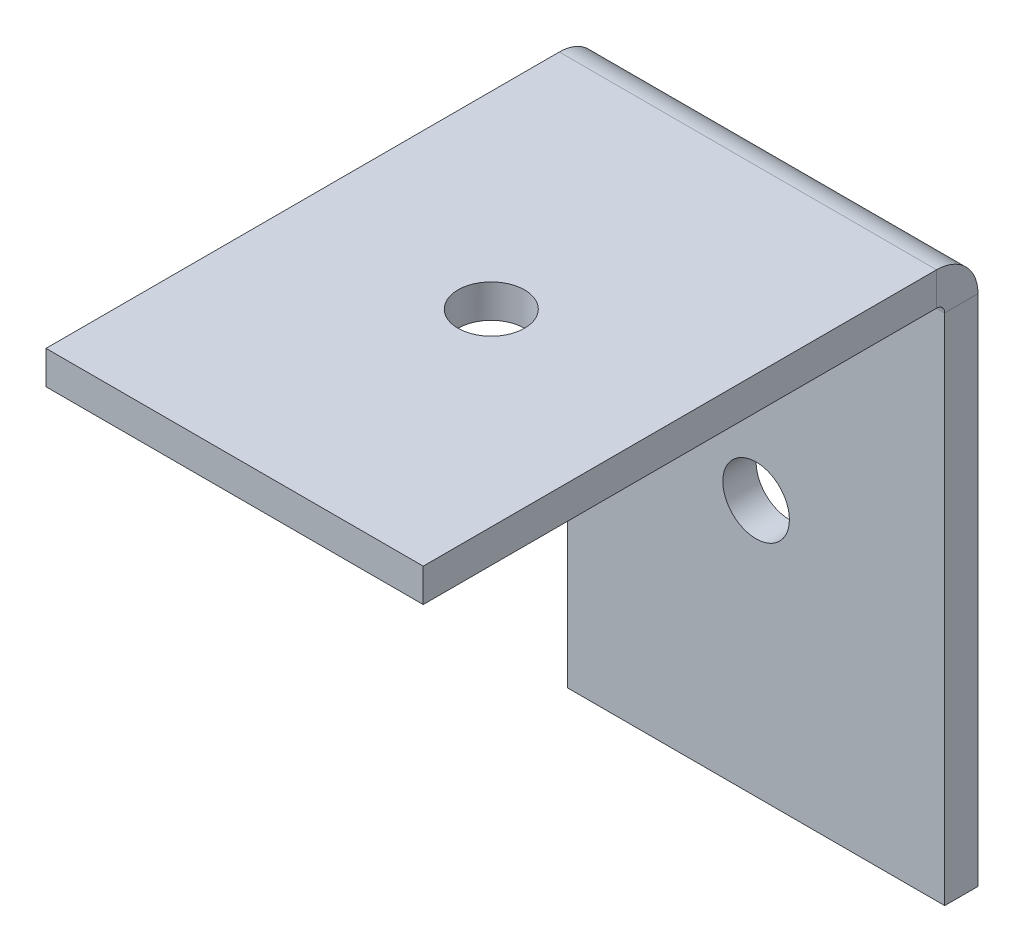
ISO-10303-21;
HEADER;
FILE_DESCRIPTION(('STEP AP214'),'2;1');
FILE_NAME('part.step','',(''),(''),'','','');
FILE_SCHEMA(('AUTOMOTIVE_DESIGN { 1 0 10303 214 1 1 1 1 }'));
ENDSEC;
DATA;
#1=APPLICATION_CONTEXT('core data for automotive mechanical design processes');
#2=APPLICATION_PROTOCOL_DEFINITION('international standard','automotive_design',2000,#1);
#3=PRODUCT_CONTEXT('',#1,'mechanical');
#4=PRODUCT('Part','Part','',(#3));
#5=PRODUCT_RELATED_PRODUCT_CATEGORY('part','',(#4));
#6=PRODUCT_DEFINITION_FORMATION('','',#4);
#7=PRODUCT_DEFINITION_CONTEXT('part definition',#1,'design');
#8=PRODUCT_DEFINITION('design','',#6,#7);
#9=PRODUCT_DEFINITION_SHAPE('','',#8);
#10=(LENGTH_UNIT() NAMED_UNIT(*) SI_UNIT(.MILLI.,.METRE.));
#11=(NAMED_UNIT(*) PLANE_ANGLE_UNIT() SI_UNIT($,.RADIAN.));
#12=(NAMED_UNIT(*) SI_UNIT($,.STERADIAN.) SOLID_ANGLE_UNIT());
#13=UNCERTAINTY_MEASURE_WITH_UNIT(LENGTH_MEASURE(1.E-05),#10,'distance_accuracy_value','');
#14=(GEOMETRIC_REPRESENTATION_CONTEXT(3) GLOBAL_UNCERTAINTY_ASSIGNED_CONTEXT((#13)) GLOBAL_UNIT_ASSIGNED_CONTEXT((#10,
#11,#12)) REPRESENTATION_CONTEXT('',''));
#15=CARTESIAN_POINT('',(0.,0.,0.));
#16=DIRECTION('',(0.,0.,1.));
#17=DIRECTION('',(1.,0.,0.));
#18=AXIS2_PLACEMENT_3D('',#15,#16,#17);
#19=CARTESIAN_POINT('',(0.,50.,3.));
#20=DIRECTION('',(0.,0.,-1.));
#21=DIRECTION('',(-1.,0.,0.));
#22=AXIS2_PLACEMENT_3D('',#19,#20,#21);
#23=PLANE('',#22);
#24=CARTESIAN_POINT('',(17.,23.1317,3.));
#25=DIRECTION('',(0.,0.,1.));
#26=DIRECTION('',(1.,0.,0.));
#27=AXIS2_PLACEMENT_3D('',#24,#25,#26);
#28=CIRCLE('',#27,3.);
#29=CARTESIAN_POINT('',(20.,23.1317,3.));
#30=VERTEX_POINT('',#29);
#31=EDGE_CURVE('E219',#30,#30,#28,.T.);
#32=ORIENTED_EDGE('',*,*,#31,.F.);
#33=EDGE_LOOP('',(#32));
#34=FACE_BOUND('',#33,.T.);
#35=DIRECTION('',(-1.,0.,0.));
#36=VECTOR('',#35,1.);
#37=CARTESIAN_POINT('',(0.,46.2634,3.00000000000001));
#38=LINE('',#37,#36);
#39=CARTESIAN_POINT('',(0.,46.2634,3.00000000000001));
#40=VERTEX_POINT('',#39);
#41=CARTESIAN_POINT('',(34.,46.2634,3.00000000000001));
#42=VERTEX_POINT('',#41);
#43=EDGE_CURVE('E188',#40,#42,#38,.F.);
#44=ORIENTED_EDGE('',*,*,#43,.F.);
#45=DIRECTION('',(0.,-1.,0.));
#46=VECTOR('',#45,1.);
#47=CARTESIAN_POINT('',(0.,50.,3.));
#48=LINE('',#47,#46);
#49=CARTESIAN_POINT('',(0.,0.,3.));
#50=VERTEX_POINT('',#49);
#51=EDGE_CURVE('E79',#40,#50,#48,.T.);
#52=ORIENTED_EDGE('',*,*,#51,.T.);
#53=DIRECTION('',(1.,0.,0.));
#54=VECTOR('',#53,1.);
#55=CARTESIAN_POINT('',(0.,0.,3.));
#56=LINE('',#55,#54);
#57=CARTESIAN_POINT('',(34.,0.,3.));
#58=VERTEX_POINT('',#57);
#59=EDGE_CURVE('E196',#50,#58,#56,.T.);
#60=ORIENTED_EDGE('',*,*,#59,.T.);
#61=DIRECTION('',(0.,-1.,0.));
#62=VECTOR('',#61,1.);
#63=CARTESIAN_POINT('',(34.,50.,3.));
#64=LINE('',#63,#62);
#65=EDGE_CURVE('E13',#42,#58,#64,.T.);
#66=ORIENTED_EDGE('',*,*,#65,.F.);
#67=EDGE_LOOP('',(#44,#52,#60,#66));
#68=FACE_BOUND('',#67,.T.);
#69=ADVANCED_FACE('F63',(#34,#68),#23,.F.);
#70=CARTESIAN_POINT('',(0.,50.,0.));
#71=DIRECTION('',(0.,0.,-1.));
#72=DIRECTION('',(-1.,0.,0.));
#73=AXIS2_PLACEMENT_3D('',#70,#71,#72);
#74=PLANE('',#73);
#75=CARTESIAN_POINT('',(17.,23.1317,0.));
#76=DIRECTION('',(0.,0.,-1.));
#77=DIRECTION('',(-1.,0.,0.));
#78=AXIS2_PLACEMENT_3D('',#75,#76,#77);
#79=CIRCLE('',#78,3.);
#80=CARTESIAN_POINT('',(14.,23.1317,0.));
#81=VERTEX_POINT('',#80);
#82=EDGE_CURVE('E66',#81,#81,#79,.T.);
#83=ORIENTED_EDGE('',*,*,#82,.F.);
#84=EDGE_LOOP('',(#83));
#85=FACE_BOUND('',#84,.T.);
#86=DIRECTION('',(0.,-1.,0.));
#87=VECTOR('',#86,1.);
#88=CARTESIAN_POINT('',(0.,50.,0.));
#89=LINE('',#88,#87);
#90=CARTESIAN_POINT('',(0.,46.2634,0.));
#91=VERTEX_POINT('',#90);
#92=CARTESIAN_POINT('',(0.,0.,0.));
#93=VERTEX_POINT('',#92);
#94=EDGE_CURVE('E87',#91,#93,#89,.T.);
#95=ORIENTED_EDGE('',*,*,#94,.F.);
#96=DIRECTION('',(-1.,0.,0.));
#97=VECTOR('',#96,1.);
#98=CARTESIAN_POINT('',(0.,46.2634,0.));
#99=LINE('',#98,#97);
#100=CARTESIAN_POINT('',(34.,46.2634,0.));
#101=VERTEX_POINT('',#100);
#102=EDGE_CURVE('E175',#91,#101,#99,.F.);
#103=ORIENTED_EDGE('',*,*,#102,.T.);
#104=DIRECTION('',(0.,-1.,0.));
#105=VECTOR('',#104,1.);
#106=CARTESIAN_POINT('',(34.,50.,0.));
#107=LINE('',#106,#105);
#108=CARTESIAN_POINT('',(34.,0.,0.));
#109=VERTEX_POINT('',#108);
#110=EDGE_CURVE('E71',#101,#109,#107,.T.);
#111=ORIENTED_EDGE('',*,*,#110,.T.);
#112=DIRECTION('',(1.,0.,0.));
#113=VECTOR('',#112,1.);
#114=CARTESIAN_POINT('',(0.,0.,0.));
#115=LINE('',#114,#113);
#116=EDGE_CURVE('E202',#93,#109,#115,.T.);
#117=ORIENTED_EDGE('',*,*,#116,.F.);
#118=EDGE_LOOP('',(#95,#103,#111,#117));
#119=FACE_BOUND('',#118,.T.);
#120=ADVANCED_FACE('F246',(#85,#119),#74,.T.);
#121=CARTESIAN_POINT('',(0.,50.,3.));
#122=DIRECTION('',(-1.,0.,0.));
#123=DIRECTION('',(0.,0.,1.));
#124=AXIS2_PLACEMENT_3D('',#121,#122,#123);
#125=PLANE('',#124);
#126=ORIENTED_EDGE('',*,*,#51,.F.);
#127=DIRECTION('',(0.,0.,-1.));
#128=VECTOR('',#127,1.);
#129=CARTESIAN_POINT('',(0.,46.2634,3.00000000000001));
#130=LINE('',#129,#128);
#131=EDGE_CURVE('E182',#40,#91,#130,.T.);
#132=ORIENTED_EDGE('',*,*,#131,.T.);
#133=ORIENTED_EDGE('',*,*,#94,.T.);
#134=DIRECTION('',(0.,0.,-1.));
#135=VECTOR('',#134,1.);
#136=CARTESIAN_POINT('',(0.,0.,3.));
#137=LINE('',#136,#135);
#138=EDGE_CURVE('E205',#50,#93,#137,.T.);
#139=ORIENTED_EDGE('',*,*,#138,.F.);
#140=EDGE_LOOP('',(#126,#132,#133,#139));
#141=FACE_BOUND('',#140,.T.);
#142=ADVANCED_FACE('F251',(#141),#125,.T.);
#143=CARTESIAN_POINT('',(34.,50.,0.));
#144=DIRECTION('',(1.,0.,0.));
#145=DIRECTION('',(0.,0.,-1.));
#146=AXIS2_PLACEMENT_3D('',#143,#144,#145);
#147=PLANE('',#146);
#148=DIRECTION('',(0.,0.,-1.));
#149=VECTOR('',#148,1.);
#150=CARTESIAN_POINT('',(34.,46.2634,3.00000000000001));
#151=LINE('',#150,#149);
#152=EDGE_CURVE('E193',#42,#101,#151,.T.);
#153=ORIENTED_EDGE('',*,*,#152,.F.);
#154=ORIENTED_EDGE('',*,*,#65,.T.);
#155=DIRECTION('',(0.,0.,1.));
#156=VECTOR('',#155,1.);
#157=CARTESIAN_POINT('',(34.,0.,0.));
#158=LINE('',#157,#156);
#159=EDGE_CURVE('E199',#109,#58,#158,.T.);
#160=ORIENTED_EDGE('',*,*,#159,.F.);
#161=ORIENTED_EDGE('',*,*,#110,.F.);
#162=EDGE_LOOP('',(#153,#154,#160,#161));
#163=FACE_BOUND('',#162,.T.);
#164=ADVANCED_FACE('F263',(#163),#147,.T.);
#165=CARTESIAN_POINT('',(0.,0.,0.));
#166=DIRECTION('',(0.,-1.,0.));
#167=DIRECTION('',(-1.,0.,0.));
#168=AXIS2_PLACEMENT_3D('',#165,#166,#167);
#169=PLANE('',#168);
#170=ORIENTED_EDGE('',*,*,#59,.F.);
#171=ORIENTED_EDGE('',*,*,#138,.T.);
#172=ORIENTED_EDGE('',*,*,#116,.T.);
#173=ORIENTED_EDGE('',*,*,#159,.T.);
#174=EDGE_LOOP('',(#170,#171,#172,#173));
#175=FACE_BOUND('',#174,.T.);
#176=ADVANCED_FACE('F258',(#175),#169,.T.);
#177=CARTESIAN_POINT('',(34.,46.2634,3.7366));
#178=DIRECTION('',(1.,0.,0.));
#179=DIRECTION('',(0.,0.,-1.));
#180=AXIS2_PLACEMENT_3D('',#177,#178,#179);
#181=PLANE('',#180);
#182=DIRECTION('',(0.,-1.,0.));
#183=VECTOR('',#182,1.);
#184=CARTESIAN_POINT('',(34.,50.,3.73659999999999));
#185=LINE('',#184,#183);
#186=CARTESIAN_POINT('',(34.,47.,3.7366));
#187=VERTEX_POINT('',#186);
#188=CARTESIAN_POINT('',(34.,50.,3.73659999999999));
#189=VERTEX_POINT('',#188);
#190=EDGE_CURVE('E156',#187,#189,#185,.F.);
#191=ORIENTED_EDGE('',*,*,#190,.F.);
#192=CARTESIAN_POINT('',(34.,46.2634,3.7366));
#193=DIRECTION('',(-1.,0.,0.));
#194=DIRECTION('',(0.,0.,1.));
#195=AXIS2_PLACEMENT_3D('',#192,#193,#194);
#196=CIRCLE('',#195,0.736599999999997);
#197=EDGE_CURVE('E185',#42,#187,#196,.F.);
#198=ORIENTED_EDGE('',*,*,#197,.F.);
#199=ORIENTED_EDGE('',*,*,#152,.T.);
#200=CARTESIAN_POINT('',(34.,46.2634,3.7366));
#201=DIRECTION('',(-1.,0.,0.));
#202=DIRECTION('',(0.,0.,1.));
#203=AXIS2_PLACEMENT_3D('',#200,#201,#202);
#204=CIRCLE('',#203,3.7366);
#205=EDGE_CURVE('E178',#101,#189,#204,.F.);
#206=ORIENTED_EDGE('',*,*,#205,.T.);
#207=EDGE_LOOP('',(#191,#198,#199,#206));
#208=FACE_BOUND('',#207,.T.);
#209=ADVANCED_FACE('F265',(#208),#181,.T.);
#210=CARTESIAN_POINT('',(0.,46.2634,3.7366));
#211=DIRECTION('',(1.,0.,0.));
#212=DIRECTION('',(0.,0.,-1.));
#213=AXIS2_PLACEMENT_3D('',#210,#211,#212);
#214=PLANE('',#213);
#215=CARTESIAN_POINT('',(0.,46.2634,3.7366));
#216=DIRECTION('',(-1.,0.,0.));
#217=DIRECTION('',(0.,0.,1.));
#218=AXIS2_PLACEMENT_3D('',#215,#216,#217);
#219=CIRCLE('',#218,0.736599999999997);
#220=CARTESIAN_POINT('',(0.,47.,3.7366));
#221=VERTEX_POINT('',#220);
#222=EDGE_CURVE('E190',#221,#40,#219,.T.);
#223=ORIENTED_EDGE('',*,*,#222,.F.);
#224=DIRECTION('',(0.,-1.,0.));
#225=VECTOR('',#224,1.);
#226=CARTESIAN_POINT('',(0.,47.,3.7366));
#227=LINE('',#226,#225);
#228=CARTESIAN_POINT('',(0.,50.,3.73659999999999));
#229=VERTEX_POINT('',#228);
#230=EDGE_CURVE('E168',#221,#229,#227,.F.);
#231=ORIENTED_EDGE('',*,*,#230,.T.);
#232=CARTESIAN_POINT('',(0.,46.2634,3.7366));
#233=DIRECTION('',(-1.,0.,0.));
#234=DIRECTION('',(0.,0.,1.));
#235=AXIS2_PLACEMENT_3D('',#232,#233,#234);
#236=CIRCLE('',#235,3.7366);
#237=EDGE_CURVE('E179',#229,#91,#236,.T.);
#238=ORIENTED_EDGE('',*,*,#237,.T.);
#239=ORIENTED_EDGE('',*,*,#131,.F.);
#240=EDGE_LOOP('',(#223,#231,#238,#239));
#241=FACE_BOUND('',#240,.T.);
#242=ADVANCED_FACE('F232',(#241),#214,.F.);
#243=CARTESIAN_POINT('',(0.,46.2634,3.7366));
#244=DIRECTION('',(-1.,0.,0.));
#245=DIRECTION('',(0.,1.,0.));
#246=AXIS2_PLACEMENT_3D('',#243,#244,#245);
#247=CYLINDRICAL_SURFACE('',#246,3.7366);
#248=ORIENTED_EDGE('',*,*,#102,.F.);
#249=ORIENTED_EDGE('',*,*,#237,.F.);
#250=DIRECTION('',(-1.,0.,0.));
#251=VECTOR('',#250,1.);
#252=CARTESIAN_POINT('',(34.,50.,3.73659999999999));
#253=LINE('',#252,#251);
#254=EDGE_CURVE('E166',#229,#189,#253,.F.);
#255=ORIENTED_EDGE('',*,*,#254,.T.);
#256=ORIENTED_EDGE('',*,*,#205,.F.);
#257=EDGE_LOOP('',(#248,#249,#255,#256));
#258=FACE_BOUND('',#257,.T.);
#259=ADVANCED_FACE('F241',(#258),#247,.T.);
#260=CARTESIAN_POINT('',(0.,46.2634,3.7366));
#261=DIRECTION('',(-1.,0.,0.));
#262=DIRECTION('',(0.,1.,0.));
#263=AXIS2_PLACEMENT_3D('',#260,#261,#262);
#264=CYLINDRICAL_SURFACE('',#263,0.736599999999997);
#265=ORIENTED_EDGE('',*,*,#43,.T.);
#266=ORIENTED_EDGE('',*,*,#197,.T.);
#267=DIRECTION('',(-1.,0.,0.));
#268=VECTOR('',#267,1.);
#269=CARTESIAN_POINT('',(34.,47.,3.7366));
#270=LINE('',#269,#268);
#271=EDGE_CURVE('E171',#187,#221,#270,.T.);
#272=ORIENTED_EDGE('',*,*,#271,.T.);
#273=ORIENTED_EDGE('',*,*,#222,.T.);
#274=EDGE_LOOP('',(#265,#266,#272,#273));
#275=FACE_BOUND('',#274,.T.);
#276=ADVANCED_FACE('F228',(#275),#264,.F.);
#277=CARTESIAN_POINT('',(0.,50.0000000000002,50.));
#278=DIRECTION('',(1.,0.,0.));
#279=DIRECTION('',(0.,0.,-1.));
#280=AXIS2_PLACEMENT_3D('',#277,#278,#279);
#281=PLANE('',#280);
#282=ORIENTED_EDGE('',*,*,#230,.F.);
#283=DIRECTION('',(0.,0.,-1.));
#284=VECTOR('',#283,1.);
#285=CARTESIAN_POINT('',(0.,47.0000000000002,50.));
#286=LINE('',#285,#284);
#287=CARTESIAN_POINT('',(0.,47.0000000000002,50.));
#288=VERTEX_POINT('',#287);
#289=EDGE_CURVE('E164',#221,#288,#286,.F.);
#290=ORIENTED_EDGE('',*,*,#289,.T.);
#291=DIRECTION('',(0.,-1.,0.));
#292=VECTOR('',#291,1.);
#293=CARTESIAN_POINT('',(0.,50.0000000000002,50.));
#294=LINE('',#293,#292);
#295=CARTESIAN_POINT('',(0.,50.0000000000002,50.));
#296=VERTEX_POINT('',#295);
#297=EDGE_CURVE('E152',#296,#288,#294,.T.);
#298=ORIENTED_EDGE('',*,*,#297,.F.);
#299=DIRECTION('',(0.,0.,1.));
#300=VECTOR('',#299,1.);
#301=CARTESIAN_POINT('',(0.,50.,-1.87637692626927E-13));
#302=LINE('',#301,#300);
#303=EDGE_CURVE('E139',#229,#296,#302,.T.);
#304=ORIENTED_EDGE('',*,*,#303,.F.);
#305=EDGE_LOOP('',(#282,#290,#298,#304));
#306=FACE_BOUND('',#305,.T.);
#307=ADVANCED_FACE('F233',(#306),#281,.F.);
#308=CARTESIAN_POINT('',(34.,50.,2.99999999999999));
#309=DIRECTION('',(-1.,0.,0.));
#310=DIRECTION('',(0.,0.,1.));
#311=AXIS2_PLACEMENT_3D('',#308,#309,#310);
#312=PLANE('',#311);
#313=ORIENTED_EDGE('',*,*,#190,.T.);
#314=DIRECTION('',(0.,0.,-1.));
#315=VECTOR('',#314,1.);
#316=CARTESIAN_POINT('',(34.,50.,-1.87637692626927E-13));
#317=LINE('',#316,#315);
#318=CARTESIAN_POINT('',(34.,50.0000000000002,50.));
#319=VERTEX_POINT('',#318);
#320=EDGE_CURVE('E137',#319,#189,#317,.T.);
#321=ORIENTED_EDGE('',*,*,#320,.F.);
#322=DIRECTION('',(0.,-1.,0.));
#323=VECTOR('',#322,1.);
#324=CARTESIAN_POINT('',(34.,50.0000000000002,50.));
#325=LINE('',#324,#323);
#326=CARTESIAN_POINT('',(34.,47.0000000000002,50.));
#327=VERTEX_POINT('',#326);
#328=EDGE_CURVE('E145',#319,#327,#325,.T.);
#329=ORIENTED_EDGE('',*,*,#328,.T.);
#330=DIRECTION('',(0.,0.,1.));
#331=VECTOR('',#330,1.);
#332=CARTESIAN_POINT('',(34.,47.,3.));
#333=LINE('',#332,#331);
#334=EDGE_CURVE('E161',#327,#187,#333,.F.);
#335=ORIENTED_EDGE('',*,*,#334,.T.);
#336=EDGE_LOOP('',(#313,#321,#329,#335));
#337=FACE_BOUND('',#336,.T.);
#338=ADVANCED_FACE('F155',(#337),#312,.F.);
#339=CARTESIAN_POINT('',(0.,50.,-1.87637692626927E-13));
#340=DIRECTION('',(0.,-1.,0.));
#341=DIRECTION('',(0.,0.,-1.));
#342=AXIS2_PLACEMENT_3D('',#339,#340,#341);
#343=PLANE('',#342);
#344=CARTESIAN_POINT('',(17.,50.0000000000001,26.8683));
#345=DIRECTION('',(0.,1.,0.));
#346=DIRECTION('',(0.,0.,1.));
#347=AXIS2_PLACEMENT_3D('',#344,#345,#346);
#348=CIRCLE('',#347,3.);
#349=CARTESIAN_POINT('',(17.,50.0000000000001,29.8683));
#350=VERTEX_POINT('',#349);
#351=EDGE_CURVE('E211',#350,#350,#348,.T.);
#352=ORIENTED_EDGE('',*,*,#351,.F.);
#353=EDGE_LOOP('',(#352));
#354=FACE_BOUND('',#353,.T.);
#355=ORIENTED_EDGE('',*,*,#254,.F.);
#356=ORIENTED_EDGE('',*,*,#303,.T.);
#357=DIRECTION('',(1.,0.,0.));
#358=VECTOR('',#357,1.);
#359=CARTESIAN_POINT('',(0.,50.0000000000002,50.));
#360=LINE('',#359,#358);
#361=EDGE_CURVE('E132',#296,#319,#360,.T.);
#362=ORIENTED_EDGE('',*,*,#361,.T.);
#363=ORIENTED_EDGE('',*,*,#320,.T.);
#364=EDGE_LOOP('',(#355,#356,#362,#363));
#365=FACE_BOUND('',#364,.T.);
#366=ADVANCED_FACE('F135',(#354,#365),#343,.F.);
#367=CARTESIAN_POINT('',(0.,47.,-1.77163248610397E-13));
#368=DIRECTION('',(0.,-1.,0.));
#369=DIRECTION('',(0.,0.,-1.));
#370=AXIS2_PLACEMENT_3D('',#367,#368,#369);
#371=PLANE('',#370);
#372=CARTESIAN_POINT('',(17.,47.0000000000001,26.8683));
#373=DIRECTION('',(0.,-1.,0.));
#374=DIRECTION('',(0.,0.,-1.));
#375=AXIS2_PLACEMENT_3D('',#372,#373,#374);
#376=CIRCLE('',#375,3.);
#377=CARTESIAN_POINT('',(17.,47.0000000000001,23.8683));
#378=VERTEX_POINT('',#377);
#379=EDGE_CURVE('E174',#378,#378,#376,.T.);
#380=ORIENTED_EDGE('',*,*,#379,.F.);
#381=EDGE_LOOP('',(#380));
#382=FACE_BOUND('',#381,.T.);
#383=ORIENTED_EDGE('',*,*,#289,.F.);
#384=ORIENTED_EDGE('',*,*,#271,.F.);
#385=ORIENTED_EDGE('',*,*,#334,.F.);
#386=DIRECTION('',(-1.,0.,0.));
#387=VECTOR('',#386,1.);
#388=CARTESIAN_POINT('',(34.,47.0000000000002,50.));
#389=LINE('',#388,#387);
#390=EDGE_CURVE('E148',#288,#327,#389,.F.);
#391=ORIENTED_EDGE('',*,*,#390,.F.);
#392=EDGE_LOOP('',(#383,#384,#385,#391));
#393=FACE_BOUND('',#392,.T.);
#394=ADVANCED_FACE('F224',(#382,#393),#371,.T.);
#395=CARTESIAN_POINT('',(34.,50.0000000000002,50.));
#396=DIRECTION('',(0.,0.,-1.));
#397=DIRECTION('',(0.,1.,0.));
#398=AXIS2_PLACEMENT_3D('',#395,#396,#397);
#399=PLANE('',#398);
#400=ORIENTED_EDGE('',*,*,#390,.T.);
#401=ORIENTED_EDGE('',*,*,#328,.F.);
#402=ORIENTED_EDGE('',*,*,#361,.F.);
#403=ORIENTED_EDGE('',*,*,#297,.T.);
#404=EDGE_LOOP('',(#400,#401,#402,#403));
#405=FACE_BOUND('',#404,.T.);
#406=ADVANCED_FACE('F146',(#405),#399,.F.);
#407=CARTESIAN_POINT('',(17.,40.0000000000001,26.8683));
#408=DIRECTION('',(0.,1.,0.));
#409=DIRECTION('',(0.,0.,1.));
#410=AXIS2_PLACEMENT_3D('',#407,#408,#409);
#411=CYLINDRICAL_SURFACE('',#410,3.);
#412=ORIENTED_EDGE('',*,*,#379,.T.);
#413=EDGE_LOOP('',(#412));
#414=FACE_BOUND('',#413,.T.);
#415=ORIENTED_EDGE('',*,*,#351,.T.);
#416=EDGE_LOOP('',(#415));
#417=FACE_BOUND('',#416,.T.);
#418=ADVANCED_FACE('F332',(#414,#417),#411,.F.);
#419=CARTESIAN_POINT('',(17.,23.1317,-7.));
#420=DIRECTION('',(0.,0.,1.));
#421=DIRECTION('',(1.,0.,0.));
#422=AXIS2_PLACEMENT_3D('',#419,#420,#421);
#423=CYLINDRICAL_SURFACE('',#422,3.);
#424=ORIENTED_EDGE('',*,*,#82,.T.);
#425=EDGE_LOOP('',(#424));
#426=FACE_BOUND('',#425,.T.);
#427=ORIENTED_EDGE('',*,*,#31,.T.);
#428=EDGE_LOOP('',(#427));
#429=FACE_BOUND('',#428,.T.);
#430=ADVANCED_FACE('F358',(#426,#429),#423,.F.);
#431=CLOSED_SHELL('',(#69,#120,#142,#164,#176,#209,#242,#259,#276,#307,#338,#366,#394,#406,#418,#430));
#432=MANIFOLD_SOLID_BREP('B2',#431);
#433=ADVANCED_BREP_SHAPE_REPRESENTATION('',(#18,#432),#14);
#434=SHAPE_DEFINITION_REPRESENTATION(#9,#433);
ENDSEC;
END-ISO-10303-21;
